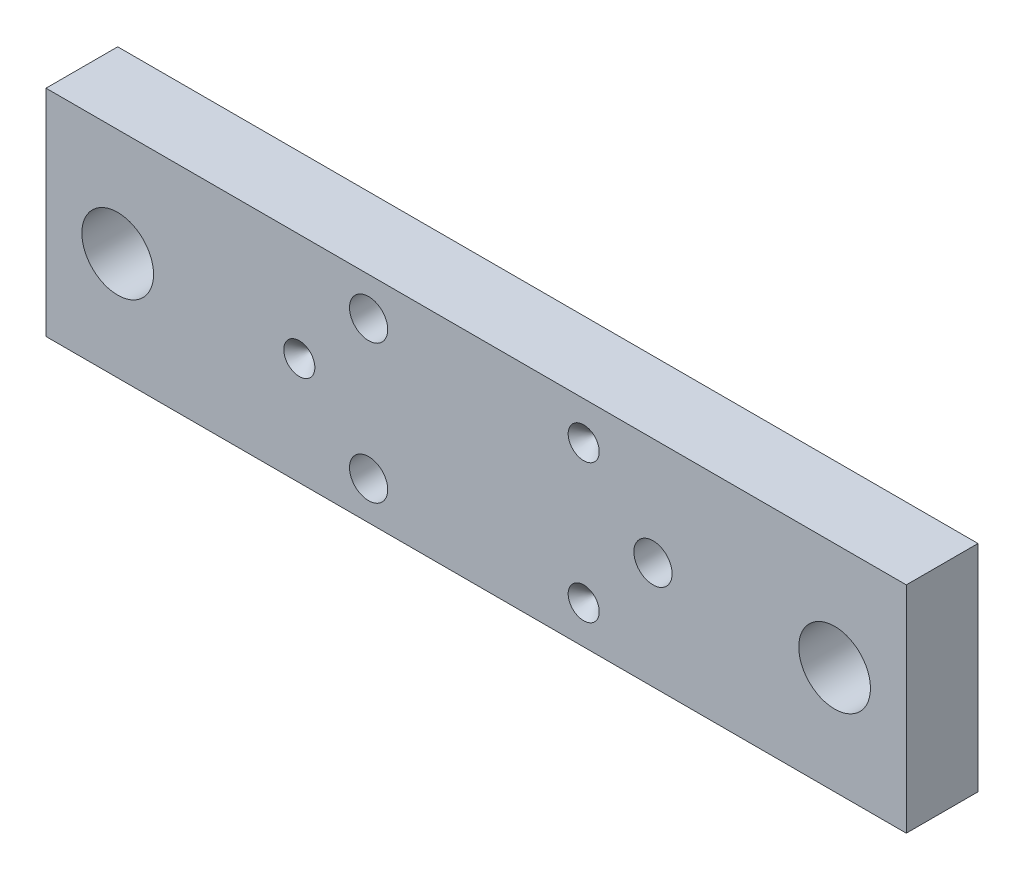
ISO-10303-21;
HEADER;
FILE_DESCRIPTION(('STEP AP214'),'2;1');
FILE_NAME('part.step','',(''),(''),'','','');
FILE_SCHEMA(('AUTOMOTIVE_DESIGN { 1 0 10303 214 1 1 1 1 }'));
ENDSEC;
DATA;
#1=APPLICATION_CONTEXT('core data for automotive mechanical design processes');
#2=APPLICATION_PROTOCOL_DEFINITION('international standard','automotive_design',2000,#1);
#3=PRODUCT_CONTEXT('',#1,'mechanical');
#4=PRODUCT('Part','Part','',(#3));
#5=PRODUCT_RELATED_PRODUCT_CATEGORY('part','',(#4));
#6=PRODUCT_DEFINITION_FORMATION('','',#4);
#7=PRODUCT_DEFINITION_CONTEXT('part definition',#1,'design');
#8=PRODUCT_DEFINITION('design','',#6,#7);
#9=PRODUCT_DEFINITION_SHAPE('','',#8);
#10=(LENGTH_UNIT() NAMED_UNIT(*) SI_UNIT(.MILLI.,.METRE.));
#11=(NAMED_UNIT(*) PLANE_ANGLE_UNIT() SI_UNIT($,.RADIAN.));
#12=(NAMED_UNIT(*) SI_UNIT($,.STERADIAN.) SOLID_ANGLE_UNIT());
#13=UNCERTAINTY_MEASURE_WITH_UNIT(LENGTH_MEASURE(1.E-05),#10,'distance_accuracy_value','');
#14=(GEOMETRIC_REPRESENTATION_CONTEXT(3) GLOBAL_UNCERTAINTY_ASSIGNED_CONTEXT((#13)) GLOBAL_UNIT_ASSIGNED_CONTEXT((#10,
#11,#12)) REPRESENTATION_CONTEXT('',''));
#15=CARTESIAN_POINT('',(0.,0.,0.));
#16=DIRECTION('',(0.,0.,1.));
#17=DIRECTION('',(1.,0.,0.));
#18=AXIS2_PLACEMENT_3D('',#15,#16,#17);
#19=CARTESIAN_POINT('',(8.11644302003173,-14.5,11.7500000000006));
#20=DIRECTION('',(0.,0.,-1.));
#21=DIRECTION('',(0.,1.,0.));
#22=AXIS2_PLACEMENT_3D('',#19,#20,#21);
#23=PLANE('',#22);
#24=CARTESIAN_POINT('',(22.5,-14.5,11.75));
#25=DIRECTION('',(0.,0.,1.));
#26=DIRECTION('',(1.,0.,0.));
#27=AXIS2_PLACEMENT_3D('',#24,#25,#26);
#28=CIRCLE('',#27,0.0500000000000002);
#29=CARTESIAN_POINT('',(22.55,-14.5,11.75));
#30=VERTEX_POINT('',#29);
#31=EDGE_CURVE('E28',#30,#30,#28,.T.);
#32=ORIENTED_EDGE('',*,*,#31,.T.);
#33=EDGE_LOOP('',(#32));
#34=FACE_BOUND('',#33,.T.);
#35=ADVANCED_FACE('F14',(#34),#23,.F.);
#36=CARTESIAN_POINT('',(22.5,0.116443020031741,11.7500000000281));
#37=DIRECTION('',(-1.88697994125741E-12,1.95825727382057E-12,1.));
#38=DIRECTION('',(0.,-1.,1.95825727382057E-12));
#39=AXIS2_PLACEMENT_3D('',#36,#37,#38);
#40=PLANE('',#39);
#41=CARTESIAN_POINT('',(22.5,14.5,11.75));
#42=DIRECTION('',(0.,0.,1.));
#43=DIRECTION('',(1.,0.,0.));
#44=AXIS2_PLACEMENT_3D('',#41,#42,#43);
#45=CIRCLE('',#44,0.0499999999999994);
#46=CARTESIAN_POINT('',(22.55,14.5,11.75));
#47=VERTEX_POINT('',#46);
#48=EDGE_CURVE('E33',#47,#47,#45,.T.);
#49=ORIENTED_EDGE('',*,*,#48,.T.);
#50=EDGE_LOOP('',(#49));
#51=FACE_BOUND('',#50,.T.);
#52=ADVANCED_FACE('F353',(#51),#40,.T.);
#53=CARTESIAN_POINT('',(-37.,-14.3835569799683,11.75));
#54=DIRECTION('',(0.,0.,1.));
#55=DIRECTION('',(1.,0.,0.));
#56=AXIS2_PLACEMENT_3D('',#53,#54,#55);
#57=PLANE('',#56);
#58=CARTESIAN_POINT('',(-37.,0.,11.75));
#59=DIRECTION('',(0.,0.,1.));
#60=DIRECTION('',(0.,-1.,0.));
#61=AXIS2_PLACEMENT_3D('',#58,#59,#60);
#62=CIRCLE('',#61,0.0499999999999996);
#63=CARTESIAN_POINT('',(-36.95,0.,11.75));
#64=VERTEX_POINT('',#63);
#65=EDGE_CURVE('E121',#64,#64,#62,.T.);
#66=ORIENTED_EDGE('',*,*,#65,.T.);
#67=EDGE_LOOP('',(#66));
#68=FACE_BOUND('',#67,.T.);
#69=ADVANCED_FACE('F311',(#68),#57,.T.);
#70=CARTESIAN_POINT('',(22.5,-14.5,11.8));
#71=DIRECTION('',(0.,0.,-1.));
#72=DIRECTION('',(-1.,0.,0.));
#73=AXIS2_PLACEMENT_3D('',#70,#71,#72);
#74=CYLINDRICAL_SURFACE('',#73,0.0500000000000002);
#75=ORIENTED_EDGE('',*,*,#31,.F.);
#76=EDGE_LOOP('',(#75));
#77=FACE_BOUND('',#76,.T.);
#78=CARTESIAN_POINT('',(22.5,-14.5,11.8));
#79=DIRECTION('',(0.,0.,1.));
#80=DIRECTION('',(1.,0.,0.));
#81=AXIS2_PLACEMENT_3D('',#78,#79,#80);
#82=CIRCLE('',#81,0.0499999999999955);
#83=CARTESIAN_POINT('',(22.55,-14.5,11.8));
#84=VERTEX_POINT('',#83);
#85=EDGE_CURVE('E116',#84,#84,#82,.T.);
#86=ORIENTED_EDGE('',*,*,#85,.T.);
#87=EDGE_LOOP('',(#86));
#88=FACE_BOUND('',#87,.T.);
#89=ADVANCED_FACE('F307',(#77,#88),#74,.F.);
#90=CARTESIAN_POINT('',(22.5,14.5,11.8));
#91=DIRECTION('',(0.,0.,-1.));
#92=DIRECTION('',(-1.,0.,0.));
#93=AXIS2_PLACEMENT_3D('',#90,#91,#92);
#94=CYLINDRICAL_SURFACE('',#93,0.0499999999999994);
#95=ORIENTED_EDGE('',*,*,#48,.F.);
#96=EDGE_LOOP('',(#95));
#97=FACE_BOUND('',#96,.T.);
#98=CARTESIAN_POINT('',(22.5,14.5,11.8));
#99=DIRECTION('',(0.,0.,1.));
#100=DIRECTION('',(1.,0.,0.));
#101=AXIS2_PLACEMENT_3D('',#98,#99,#100);
#102=CIRCLE('',#101,0.0499999999999927);
#103=CARTESIAN_POINT('',(22.55,14.5,11.8));
#104=VERTEX_POINT('',#103);
#105=EDGE_CURVE('E111',#104,#104,#102,.T.);
#106=ORIENTED_EDGE('',*,*,#105,.T.);
#107=EDGE_LOOP('',(#106));
#108=FACE_BOUND('',#107,.T.);
#109=ADVANCED_FACE('F182',(#97,#108),#94,.F.);
#110=CARTESIAN_POINT('',(-37.,0.,11.8));
#111=DIRECTION('',(0.,0.,-1.));
#112=DIRECTION('',(0.,1.,0.));
#113=AXIS2_PLACEMENT_3D('',#110,#111,#112);
#114=CYLINDRICAL_SURFACE('',#113,0.0499999999999996);
#115=ORIENTED_EDGE('',*,*,#65,.F.);
#116=EDGE_LOOP('',(#115));
#117=FACE_BOUND('',#116,.T.);
#118=CARTESIAN_POINT('',(-37.,0.,11.8));
#119=DIRECTION('',(0.,0.,1.));
#120=DIRECTION('',(0.,-1.,0.));
#121=AXIS2_PLACEMENT_3D('',#118,#119,#120);
#122=CIRCLE('',#121,0.0499999999999996);
#123=CARTESIAN_POINT('',(-37.,-0.0500000000000196,11.8));
#124=VERTEX_POINT('',#123);
#125=EDGE_CURVE('E108',#124,#124,#122,.T.);
#126=ORIENTED_EDGE('',*,*,#125,.T.);
#127=EDGE_LOOP('',(#126));
#128=FACE_BOUND('',#127,.T.);
#129=ADVANCED_FACE('F171',(#117,#128),#114,.F.);
#130=CARTESIAN_POINT('',(22.5,-14.5,15.));
#131=DIRECTION('',(0.,0.,1.));
#132=DIRECTION('',(1.,0.,0.));
#133=AXIS2_PLACEMENT_3D('',#130,#131,#132);
#134=CONICAL_SURFACE('',#133,3.25,0.785398163397449);
#135=ORIENTED_EDGE('',*,*,#85,.F.);
#136=EDGE_LOOP('',(#135));
#137=FACE_BOUND('',#136,.T.);
#138=CARTESIAN_POINT('',(22.5,-14.5,15.));
#139=DIRECTION('',(0.,0.,1.));
#140=DIRECTION('',(1.,0.,0.));
#141=AXIS2_PLACEMENT_3D('',#138,#139,#140);
#142=CIRCLE('',#141,3.25);
#143=CARTESIAN_POINT('',(25.75,-14.5,15.));
#144=VERTEX_POINT('',#143);
#145=EDGE_CURVE('E17',#144,#144,#142,.F.);
#146=ORIENTED_EDGE('',*,*,#145,.F.);
#147=EDGE_LOOP('',(#146));
#148=FACE_BOUND('',#147,.T.);
#149=ADVANCED_FACE('F168',(#137,#148),#134,.F.);
#150=CARTESIAN_POINT('',(22.5,14.5,15.));
#151=DIRECTION('',(0.,0.,1.));
#152=DIRECTION('',(1.,0.,0.));
#153=AXIS2_PLACEMENT_3D('',#150,#151,#152);
#154=CONICAL_SURFACE('',#153,3.25,0.785398163397449);
#155=ORIENTED_EDGE('',*,*,#105,.F.);
#156=EDGE_LOOP('',(#155));
#157=FACE_BOUND('',#156,.T.);
#158=CARTESIAN_POINT('',(22.5,14.5,15.));
#159=DIRECTION('',(0.,0.,1.));
#160=DIRECTION('',(1.,0.,0.));
#161=AXIS2_PLACEMENT_3D('',#158,#159,#160);
#162=CIRCLE('',#161,3.25);
#163=CARTESIAN_POINT('',(25.75,14.5,15.));
#164=VERTEX_POINT('',#163);
#165=EDGE_CURVE('E158',#164,#164,#162,.F.);
#166=ORIENTED_EDGE('',*,*,#165,.F.);
#167=EDGE_LOOP('',(#166));
#168=FACE_BOUND('',#167,.T.);
#169=ADVANCED_FACE('F170',(#157,#168),#154,.F.);
#170=CARTESIAN_POINT('',(-37.,0.,15.));
#171=DIRECTION('',(0.,0.,1.));
#172=DIRECTION('',(1.,0.,0.));
#173=AXIS2_PLACEMENT_3D('',#170,#171,#172);
#174=CONICAL_SURFACE('',#173,3.25,0.785398163397449);
#175=ORIENTED_EDGE('',*,*,#125,.F.);
#176=EDGE_LOOP('',(#175));
#177=FACE_BOUND('',#176,.T.);
#178=CARTESIAN_POINT('',(-37.,0.,15.));
#179=DIRECTION('',(0.,0.,1.));
#180=DIRECTION('',(1.,0.,0.));
#181=AXIS2_PLACEMENT_3D('',#178,#179,#180);
#182=CIRCLE('',#181,3.25);
#183=CARTESIAN_POINT('',(-33.75,0.,15.));
#184=VERTEX_POINT('',#183);
#185=EDGE_CURVE('E107',#184,#184,#182,.F.);
#186=ORIENTED_EDGE('',*,*,#185,.F.);
#187=EDGE_LOOP('',(#186));
#188=FACE_BOUND('',#187,.T.);
#189=ADVANCED_FACE('F179',(#177,#188),#174,.F.);
#190=CARTESIAN_POINT('',(0.,0.,15.));
#191=DIRECTION('',(0.,0.,1.));
#192=DIRECTION('',(1.,0.,0.));
#193=AXIS2_PLACEMENT_3D('',#190,#191,#192);
#194=PLANE('',#193);
#195=CARTESIAN_POINT('',(-22.5,14.5,15.));
#196=DIRECTION('',(0.,0.,1.));
#197=DIRECTION('',(1.,0.,0.));
#198=AXIS2_PLACEMENT_3D('',#195,#196,#197);
#199=CIRCLE('',#198,4.);
#200=CARTESIAN_POINT('',(-18.5,14.5,15.));
#201=VERTEX_POINT('',#200);
#202=EDGE_CURVE('E94',#201,#201,#199,.F.);
#203=ORIENTED_EDGE('',*,*,#202,.T.);
#204=EDGE_LOOP('',(#203));
#205=FACE_BOUND('',#204,.T.);
#206=CARTESIAN_POINT('',(-22.5,-14.5,15.));
#207=DIRECTION('',(0.,0.,1.));
#208=DIRECTION('',(1.,0.,0.));
#209=AXIS2_PLACEMENT_3D('',#206,#207,#208);
#210=CIRCLE('',#209,4.);
#211=CARTESIAN_POINT('',(-18.5,-14.5,15.));
#212=VERTEX_POINT('',#211);
#213=EDGE_CURVE('E146',#212,#212,#210,.F.);
#214=ORIENTED_EDGE('',*,*,#213,.T.);
#215=EDGE_LOOP('',(#214));
#216=FACE_BOUND('',#215,.T.);
#217=CARTESIAN_POINT('',(37.,0.,15.));
#218=DIRECTION('',(0.,0.,1.));
#219=DIRECTION('',(1.,0.,0.));
#220=AXIS2_PLACEMENT_3D('',#217,#218,#219);
#221=CIRCLE('',#220,4.);
#222=CARTESIAN_POINT('',(41.,0.,15.));
#223=VERTEX_POINT('',#222);
#224=EDGE_CURVE('E149',#223,#223,#221,.F.);
#225=ORIENTED_EDGE('',*,*,#224,.T.);
#226=EDGE_LOOP('',(#225));
#227=FACE_BOUND('',#226,.T.);
#228=CARTESIAN_POINT('',(-75.,0.,15.));
#229=DIRECTION('',(0.,0.,1.));
#230=DIRECTION('',(1.,0.,0.));
#231=AXIS2_PLACEMENT_3D('',#228,#229,#230);
#232=CIRCLE('',#231,7.5);
#233=CARTESIAN_POINT('',(-67.5,0.,15.));
#234=VERTEX_POINT('',#233);
#235=EDGE_CURVE('E152',#234,#234,#232,.F.);
#236=ORIENTED_EDGE('',*,*,#235,.T.);
#237=EDGE_LOOP('',(#236));
#238=FACE_BOUND('',#237,.T.);
#239=CARTESIAN_POINT('',(75.,0.,15.));
#240=DIRECTION('',(0.,0.,1.));
#241=DIRECTION('',(1.,0.,0.));
#242=AXIS2_PLACEMENT_3D('',#239,#240,#241);
#243=CIRCLE('',#242,7.5);
#244=CARTESIAN_POINT('',(82.5,0.,15.));
#245=VERTEX_POINT('',#244);
#246=EDGE_CURVE('E95',#245,#245,#243,.F.);
#247=ORIENTED_EDGE('',*,*,#246,.T.);
#248=EDGE_LOOP('',(#247));
#249=FACE_BOUND('',#248,.T.);
#250=ORIENTED_EDGE('',*,*,#185,.T.);
#251=EDGE_LOOP('',(#250));
#252=FACE_BOUND('',#251,.T.);
#253=ORIENTED_EDGE('',*,*,#165,.T.);
#254=EDGE_LOOP('',(#253));
#255=FACE_BOUND('',#254,.T.);
#256=ORIENTED_EDGE('',*,*,#145,.T.);
#257=EDGE_LOOP('',(#256));
#258=FACE_BOUND('',#257,.T.);
#259=DIRECTION('',(0.,1.,0.));
#260=VECTOR('',#259,1.);
#261=CARTESIAN_POINT('',(90.,22.5,15.));
#262=LINE('',#261,#260);
#263=CARTESIAN_POINT('',(90.,22.5,15.));
#264=VERTEX_POINT('',#263);
#265=CARTESIAN_POINT('',(90.,-22.5,15.));
#266=VERTEX_POINT('',#265);
#267=EDGE_CURVE('E105',#264,#266,#262,.F.);
#268=ORIENTED_EDGE('',*,*,#267,.F.);
#269=DIRECTION('',(1.,0.,0.));
#270=VECTOR('',#269,1.);
#271=CARTESIAN_POINT('',(-90.,22.5,15.));
#272=LINE('',#271,#270);
#273=CARTESIAN_POINT('',(-90.,22.5,15.));
#274=VERTEX_POINT('',#273);
#275=EDGE_CURVE('E103',#274,#264,#272,.T.);
#276=ORIENTED_EDGE('',*,*,#275,.F.);
#277=DIRECTION('',(0.,1.,0.));
#278=VECTOR('',#277,1.);
#279=CARTESIAN_POINT('',(-90.,-22.5,15.));
#280=LINE('',#279,#278);
#281=CARTESIAN_POINT('',(-90.,-22.5,15.));
#282=VERTEX_POINT('',#281);
#283=EDGE_CURVE('E99',#282,#274,#280,.T.);
#284=ORIENTED_EDGE('',*,*,#283,.F.);
#285=DIRECTION('',(1.,0.,0.));
#286=VECTOR('',#285,1.);
#287=CARTESIAN_POINT('',(90.,-22.5,15.));
#288=LINE('',#287,#286);
#289=EDGE_CURVE('E69',#266,#282,#288,.F.);
#290=ORIENTED_EDGE('',*,*,#289,.F.);
#291=EDGE_LOOP('',(#268,#276,#284,#290));
#292=FACE_BOUND('',#291,.T.);
#293=ADVANCED_FACE('F165',(#205,#216,#227,#238,#249,#252,#255,#258,#292),#194,.T.);
#294=CARTESIAN_POINT('',(90.,22.5,0.));
#295=DIRECTION('',(1.,0.,0.));
#296=DIRECTION('',(0.,0.,-1.));
#297=AXIS2_PLACEMENT_3D('',#294,#295,#296);
#298=PLANE('',#297);
#299=DIRECTION('',(0.,1.,0.));
#300=VECTOR('',#299,1.);
#301=CARTESIAN_POINT('',(90.,0.,0.));
#302=LINE('',#301,#300);
#303=CARTESIAN_POINT('',(90.,-22.5,0.));
#304=VERTEX_POINT('',#303);
#305=CARTESIAN_POINT('',(90.,22.5,0.));
#306=VERTEX_POINT('',#305);
#307=EDGE_CURVE('E82',#304,#306,#302,.T.);
#308=ORIENTED_EDGE('',*,*,#307,.T.);
#309=DIRECTION('',(0.,0.,1.));
#310=VECTOR('',#309,1.);
#311=CARTESIAN_POINT('',(90.,22.5,0.));
#312=LINE('',#311,#310);
#313=EDGE_CURVE('E101',#264,#306,#312,.F.);
#314=ORIENTED_EDGE('',*,*,#313,.F.);
#315=ORIENTED_EDGE('',*,*,#267,.T.);
#316=DIRECTION('',(0.,0.,-1.));
#317=VECTOR('',#316,1.);
#318=CARTESIAN_POINT('',(90.,-22.5,0.));
#319=LINE('',#318,#317);
#320=EDGE_CURVE('E73',#304,#266,#319,.F.);
#321=ORIENTED_EDGE('',*,*,#320,.F.);
#322=EDGE_LOOP('',(#308,#314,#315,#321));
#323=FACE_BOUND('',#322,.T.);
#324=ADVANCED_FACE('F221',(#323),#298,.T.);
#325=CARTESIAN_POINT('',(-90.,22.5,0.));
#326=DIRECTION('',(0.,1.,0.));
#327=DIRECTION('',(0.,0.,1.));
#328=AXIS2_PLACEMENT_3D('',#325,#326,#327);
#329=PLANE('',#328);
#330=DIRECTION('',(1.,0.,0.));
#331=VECTOR('',#330,1.);
#332=CARTESIAN_POINT('',(0.,22.5,0.));
#333=LINE('',#332,#331);
#334=CARTESIAN_POINT('',(-90.,22.5,0.));
#335=VERTEX_POINT('',#334);
#336=EDGE_CURVE('E89',#306,#335,#333,.F.);
#337=ORIENTED_EDGE('',*,*,#336,.T.);
#338=DIRECTION('',(0.,0.,1.));
#339=VECTOR('',#338,1.);
#340=CARTESIAN_POINT('',(-90.,22.5,0.));
#341=LINE('',#340,#339);
#342=EDGE_CURVE('E88',#274,#335,#341,.F.);
#343=ORIENTED_EDGE('',*,*,#342,.F.);
#344=ORIENTED_EDGE('',*,*,#275,.T.);
#345=ORIENTED_EDGE('',*,*,#313,.T.);
#346=EDGE_LOOP('',(#337,#343,#344,#345));
#347=FACE_BOUND('',#346,.T.);
#348=ADVANCED_FACE('F218',(#347),#329,.T.);
#349=CARTESIAN_POINT('',(-90.,-22.5,0.));
#350=DIRECTION('',(-1.,0.,0.));
#351=DIRECTION('',(0.,0.,1.));
#352=AXIS2_PLACEMENT_3D('',#349,#350,#351);
#353=PLANE('',#352);
#354=DIRECTION('',(0.,1.,0.));
#355=VECTOR('',#354,1.);
#356=CARTESIAN_POINT('',(-90.,0.,0.));
#357=LINE('',#356,#355);
#358=CARTESIAN_POINT('',(-90.,-22.5,0.));
#359=VERTEX_POINT('',#358);
#360=EDGE_CURVE('E79',#335,#359,#357,.F.);
#361=ORIENTED_EDGE('',*,*,#360,.T.);
#362=DIRECTION('',(0.,0.,-1.));
#363=VECTOR('',#362,1.);
#364=CARTESIAN_POINT('',(-90.,-22.5,0.));
#365=LINE('',#364,#363);
#366=EDGE_CURVE('E63',#282,#359,#365,.T.);
#367=ORIENTED_EDGE('',*,*,#366,.F.);
#368=ORIENTED_EDGE('',*,*,#283,.T.);
#369=ORIENTED_EDGE('',*,*,#342,.T.);
#370=EDGE_LOOP('',(#361,#367,#368,#369));
#371=FACE_BOUND('',#370,.T.);
#372=ADVANCED_FACE('F86',(#371),#353,.T.);
#373=CARTESIAN_POINT('',(90.,-22.5,0.));
#374=DIRECTION('',(0.,-1.,0.));
#375=DIRECTION('',(0.,0.,-1.));
#376=AXIS2_PLACEMENT_3D('',#373,#374,#375);
#377=PLANE('',#376);
#378=DIRECTION('',(1.,0.,0.));
#379=VECTOR('',#378,1.);
#380=CARTESIAN_POINT('',(0.,-22.5,0.));
#381=LINE('',#380,#379);
#382=EDGE_CURVE('E67',#359,#304,#381,.T.);
#383=ORIENTED_EDGE('',*,*,#382,.T.);
#384=ORIENTED_EDGE('',*,*,#320,.T.);
#385=ORIENTED_EDGE('',*,*,#289,.T.);
#386=ORIENTED_EDGE('',*,*,#366,.T.);
#387=EDGE_LOOP('',(#383,#384,#385,#386));
#388=FACE_BOUND('',#387,.T.);
#389=ADVANCED_FACE('F65',(#388),#377,.T.);
#390=CARTESIAN_POINT('',(75.,0.,0.));
#391=DIRECTION('',(0.,0.,1.));
#392=DIRECTION('',(1.,0.,0.));
#393=AXIS2_PLACEMENT_3D('',#390,#391,#392);
#394=CYLINDRICAL_SURFACE('',#393,7.5);
#395=CARTESIAN_POINT('',(75.,0.,0.));
#396=DIRECTION('',(0.,0.,1.));
#397=DIRECTION('',(1.,0.,0.));
#398=AXIS2_PLACEMENT_3D('',#395,#396,#397);
#399=CIRCLE('',#398,7.5);
#400=CARTESIAN_POINT('',(82.5,0.,0.));
#401=VERTEX_POINT('',#400);
#402=EDGE_CURVE('E84',#401,#401,#399,.F.);
#403=ORIENTED_EDGE('',*,*,#402,.T.);
#404=EDGE_LOOP('',(#403));
#405=FACE_BOUND('',#404,.T.);
#406=ORIENTED_EDGE('',*,*,#246,.F.);
#407=EDGE_LOOP('',(#406));
#408=FACE_BOUND('',#407,.T.);
#409=ADVANCED_FACE('F209',(#405,#408),#394,.F.);
#410=CARTESIAN_POINT('',(-75.,0.,0.));
#411=DIRECTION('',(0.,0.,1.));
#412=DIRECTION('',(1.,0.,0.));
#413=AXIS2_PLACEMENT_3D('',#410,#411,#412);
#414=CYLINDRICAL_SURFACE('',#413,7.5);
#415=CARTESIAN_POINT('',(-75.,0.,0.));
#416=DIRECTION('',(0.,0.,1.));
#417=DIRECTION('',(1.,0.,0.));
#418=AXIS2_PLACEMENT_3D('',#415,#416,#417);
#419=CIRCLE('',#418,7.5);
#420=CARTESIAN_POINT('',(-67.5,0.,0.));
#421=VERTEX_POINT('',#420);
#422=EDGE_CURVE('E139',#421,#421,#419,.F.);
#423=ORIENTED_EDGE('',*,*,#422,.T.);
#424=EDGE_LOOP('',(#423));
#425=FACE_BOUND('',#424,.T.);
#426=ORIENTED_EDGE('',*,*,#235,.F.);
#427=EDGE_LOOP('',(#426));
#428=FACE_BOUND('',#427,.T.);
#429=ADVANCED_FACE('F205',(#425,#428),#414,.F.);
#430=CARTESIAN_POINT('',(37.,0.,0.));
#431=DIRECTION('',(0.,0.,1.));
#432=DIRECTION('',(1.,0.,0.));
#433=AXIS2_PLACEMENT_3D('',#430,#431,#432);
#434=CYLINDRICAL_SURFACE('',#433,4.);
#435=CARTESIAN_POINT('',(37.,0.,0.));
#436=DIRECTION('',(0.,0.,1.));
#437=DIRECTION('',(1.,0.,0.));
#438=AXIS2_PLACEMENT_3D('',#435,#436,#437);
#439=CIRCLE('',#438,4.);
#440=CARTESIAN_POINT('',(41.,0.,0.));
#441=VERTEX_POINT('',#440);
#442=EDGE_CURVE('E136',#441,#441,#439,.F.);
#443=ORIENTED_EDGE('',*,*,#442,.T.);
#444=EDGE_LOOP('',(#443));
#445=FACE_BOUND('',#444,.T.);
#446=ORIENTED_EDGE('',*,*,#224,.F.);
#447=EDGE_LOOP('',(#446));
#448=FACE_BOUND('',#447,.T.);
#449=ADVANCED_FACE('F201',(#445,#448),#434,.F.);
#450=CARTESIAN_POINT('',(-22.5,-14.5,0.));
#451=DIRECTION('',(0.,0.,1.));
#452=DIRECTION('',(1.,0.,0.));
#453=AXIS2_PLACEMENT_3D('',#450,#451,#452);
#454=CYLINDRICAL_SURFACE('',#453,4.);
#455=CARTESIAN_POINT('',(-22.5,-14.5,0.));
#456=DIRECTION('',(0.,0.,1.));
#457=DIRECTION('',(1.,0.,0.));
#458=AXIS2_PLACEMENT_3D('',#455,#456,#457);
#459=CIRCLE('',#458,4.);
#460=CARTESIAN_POINT('',(-18.5,-14.5,0.));
#461=VERTEX_POINT('',#460);
#462=EDGE_CURVE('E22',#461,#461,#459,.F.);
#463=ORIENTED_EDGE('',*,*,#462,.T.);
#464=EDGE_LOOP('',(#463));
#465=FACE_BOUND('',#464,.T.);
#466=ORIENTED_EDGE('',*,*,#213,.F.);
#467=EDGE_LOOP('',(#466));
#468=FACE_BOUND('',#467,.T.);
#469=ADVANCED_FACE('F193',(#465,#468),#454,.F.);
#470=CARTESIAN_POINT('',(-22.5,14.5,0.));
#471=DIRECTION('',(0.,0.,1.));
#472=DIRECTION('',(1.,0.,0.));
#473=AXIS2_PLACEMENT_3D('',#470,#471,#472);
#474=CYLINDRICAL_SURFACE('',#473,4.);
#475=CARTESIAN_POINT('',(-22.5,14.5,0.));
#476=DIRECTION('',(0.,0.,1.));
#477=DIRECTION('',(1.,0.,0.));
#478=AXIS2_PLACEMENT_3D('',#475,#476,#477);
#479=CIRCLE('',#478,4.);
#480=CARTESIAN_POINT('',(-18.5,14.5,0.));
#481=VERTEX_POINT('',#480);
#482=EDGE_CURVE('E9',#481,#481,#479,.F.);
#483=ORIENTED_EDGE('',*,*,#482,.T.);
#484=EDGE_LOOP('',(#483));
#485=FACE_BOUND('',#484,.T.);
#486=ORIENTED_EDGE('',*,*,#202,.F.);
#487=EDGE_LOOP('',(#486));
#488=FACE_BOUND('',#487,.T.);
#489=ADVANCED_FACE('F187',(#485,#488),#474,.F.);
#490=CARTESIAN_POINT('',(0.,0.,0.));
#491=DIRECTION('',(0.,0.,1.));
#492=DIRECTION('',(1.,0.,0.));
#493=AXIS2_PLACEMENT_3D('',#490,#491,#492);
#494=PLANE('',#493);
#495=ORIENTED_EDGE('',*,*,#482,.F.);
#496=EDGE_LOOP('',(#495));
#497=FACE_BOUND('',#496,.T.);
#498=ORIENTED_EDGE('',*,*,#462,.F.);
#499=EDGE_LOOP('',(#498));
#500=FACE_BOUND('',#499,.T.);
#501=ORIENTED_EDGE('',*,*,#442,.F.);
#502=EDGE_LOOP('',(#501));
#503=FACE_BOUND('',#502,.T.);
#504=ORIENTED_EDGE('',*,*,#422,.F.);
#505=EDGE_LOOP('',(#504));
#506=FACE_BOUND('',#505,.T.);
#507=ORIENTED_EDGE('',*,*,#402,.F.);
#508=EDGE_LOOP('',(#507));
#509=FACE_BOUND('',#508,.T.);
#510=ORIENTED_EDGE('',*,*,#360,.F.);
#511=ORIENTED_EDGE('',*,*,#336,.F.);
#512=ORIENTED_EDGE('',*,*,#307,.F.);
#513=ORIENTED_EDGE('',*,*,#382,.F.);
#514=EDGE_LOOP('',(#510,#511,#512,#513));
#515=FACE_BOUND('',#514,.T.);
#516=ADVANCED_FACE('F77',(#497,#500,#503,#506,#509,#515),#494,.F.);
#517=CLOSED_SHELL('',(#35,#52,#69,#89,#109,#129,#149,#169,#189,#293,#324,#348,#372,#389,#409,
#429,#449,#469,#489,#516));
#518=MANIFOLD_SOLID_BREP('B1',#517);
#519=ADVANCED_BREP_SHAPE_REPRESENTATION('',(#18,#518),#14);
#520=SHAPE_DEFINITION_REPRESENTATION(#9,#519);
ENDSEC;
END-ISO-10303-21;
